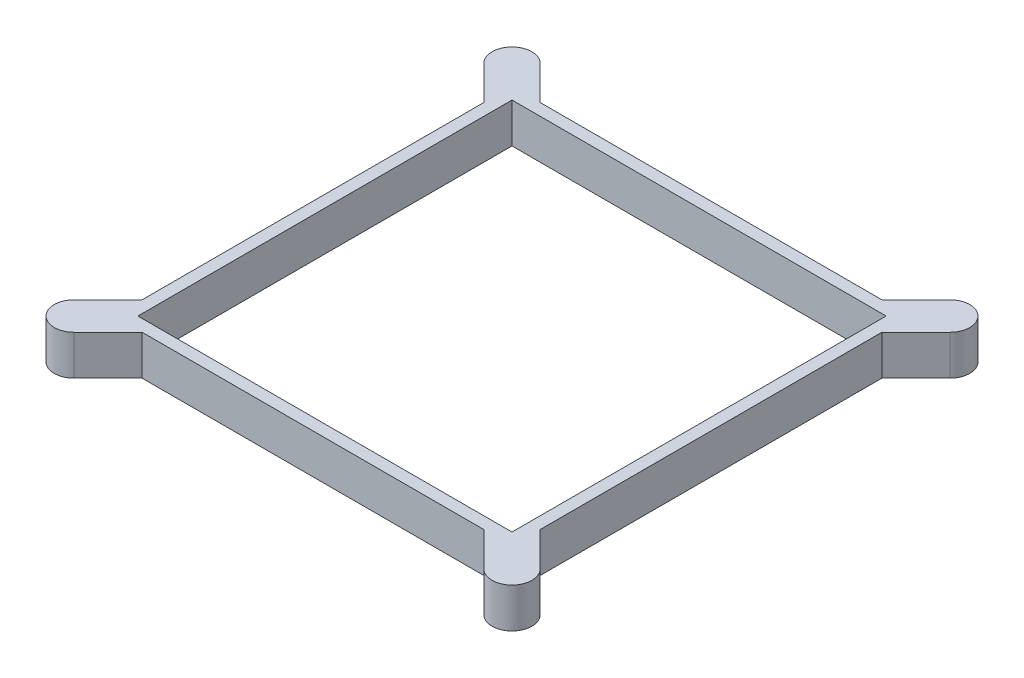
ISO-10303-21;
HEADER;
FILE_DESCRIPTION(('STEP AP214'),'2;1');
FILE_NAME('part.step','',(''),(''),'','','');
FILE_SCHEMA(('AUTOMOTIVE_DESIGN { 1 0 10303 214 1 1 1 1 }'));
ENDSEC;
DATA;
#1=APPLICATION_CONTEXT('core data for automotive mechanical design processes');
#2=APPLICATION_PROTOCOL_DEFINITION('international standard','automotive_design',2000,#1);
#3=PRODUCT_CONTEXT('',#1,'mechanical');
#4=PRODUCT('Part','Part','',(#3));
#5=PRODUCT_RELATED_PRODUCT_CATEGORY('part','',(#4));
#6=PRODUCT_DEFINITION_FORMATION('','',#4);
#7=PRODUCT_DEFINITION_CONTEXT('part definition',#1,'design');
#8=PRODUCT_DEFINITION('design','',#6,#7);
#9=PRODUCT_DEFINITION_SHAPE('','',#8);
#10=(LENGTH_UNIT() NAMED_UNIT(*) SI_UNIT(.MILLI.,.METRE.));
#11=(NAMED_UNIT(*) PLANE_ANGLE_UNIT() SI_UNIT($,.RADIAN.));
#12=(NAMED_UNIT(*) SI_UNIT($,.STERADIAN.) SOLID_ANGLE_UNIT());
#13=UNCERTAINTY_MEASURE_WITH_UNIT(LENGTH_MEASURE(1.E-05),#10,'distance_accuracy_value','');
#14=(GEOMETRIC_REPRESENTATION_CONTEXT(3) GLOBAL_UNCERTAINTY_ASSIGNED_CONTEXT((#13)) GLOBAL_UNIT_ASSIGNED_CONTEXT((#10,
#11,#12)) REPRESENTATION_CONTEXT('',''));
#15=CARTESIAN_POINT('',(0.,0.,0.));
#16=DIRECTION('',(0.,0.,1.));
#17=DIRECTION('',(1.,0.,0.));
#18=AXIS2_PLACEMENT_3D('',#15,#16,#17);
#19=CARTESIAN_POINT('',(200.,20.,0.));
#20=DIRECTION('',(-1.,0.,0.));
#21=DIRECTION('',(0.,0.,1.));
#22=AXIS2_PLACEMENT_3D('',#19,#20,#21);
#23=PLANE('',#22);
#24=DIRECTION('',(0.,-1.,0.));
#25=VECTOR('',#24,1.);
#26=CARTESIAN_POINT('',(200.,68.3076870304613,-185.857864376269));
#27=LINE('',#26,#25);
#28=CARTESIAN_POINT('',(200.,20.,-185.857864376269));
#29=VERTEX_POINT('',#28);
#30=CARTESIAN_POINT('',(200.,0.,-185.857864376269));
#31=VERTEX_POINT('',#30);
#32=EDGE_CURVE('E308',#29,#31,#27,.T.);
#33=ORIENTED_EDGE('',*,*,#32,.F.);
#34=DIRECTION('',(0.,0.,-1.));
#35=VECTOR('',#34,1.);
#36=CARTESIAN_POINT('',(200.,20.,0.));
#37=LINE('',#36,#35);
#38=CARTESIAN_POINT('',(200.,20.,-14.142135623731));
#39=VERTEX_POINT('',#38);
#40=EDGE_CURVE('E70',#39,#29,#37,.T.);
#41=ORIENTED_EDGE('',*,*,#40,.F.);
#42=DIRECTION('',(0.,-1.,0.));
#43=VECTOR('',#42,1.);
#44=CARTESIAN_POINT('',(200.,68.3076870304613,-14.142135623731));
#45=LINE('',#44,#43);
#46=CARTESIAN_POINT('',(200.,0.,-14.142135623731));
#47=VERTEX_POINT('',#46);
#48=EDGE_CURVE('E343',#39,#47,#45,.T.);
#49=ORIENTED_EDGE('',*,*,#48,.T.);
#50=DIRECTION('',(0.,0.,-1.));
#51=VECTOR('',#50,1.);
#52=CARTESIAN_POINT('',(200.,0.,0.));
#53=LINE('',#52,#51);
#54=EDGE_CURVE('E400',#47,#31,#53,.T.);
#55=ORIENTED_EDGE('',*,*,#54,.T.);
#56=EDGE_LOOP('',(#33,#41,#49,#55));
#57=FACE_BOUND('',#56,.T.);
#58=ADVANCED_FACE('F61',(#57),#23,.F.);
#59=CARTESIAN_POINT('',(0.,20.,-200.));
#60=DIRECTION('',(0.,0.,1.));
#61=DIRECTION('',(1.,0.,0.));
#62=AXIS2_PLACEMENT_3D('',#59,#60,#61);
#63=PLANE('',#62);
#64=DIRECTION('',(-1.,0.,0.));
#65=VECTOR('',#64,1.);
#66=CARTESIAN_POINT('',(0.,0.,-200.));
#67=LINE('',#66,#65);
#68=CARTESIAN_POINT('',(185.857864376269,0.,-200.));
#69=VERTEX_POINT('',#68);
#70=CARTESIAN_POINT('',(14.1421356237309,0.,-200.));
#71=VERTEX_POINT('',#70);
#72=EDGE_CURVE('E65',#69,#71,#67,.T.);
#73=ORIENTED_EDGE('',*,*,#72,.T.);
#74=DIRECTION('',(0.,-1.,0.));
#75=VECTOR('',#74,1.);
#76=CARTESIAN_POINT('',(14.142135623731,68.3076870304613,-200.));
#77=LINE('',#76,#75);
#78=CARTESIAN_POINT('',(14.1421356237309,20.,-200.));
#79=VERTEX_POINT('',#78);
#80=EDGE_CURVE('E268',#79,#71,#77,.T.);
#81=ORIENTED_EDGE('',*,*,#80,.F.);
#82=DIRECTION('',(-1.,0.,0.));
#83=VECTOR('',#82,1.);
#84=CARTESIAN_POINT('',(0.,20.,-200.));
#85=LINE('',#84,#83);
#86=CARTESIAN_POINT('',(185.857864376269,20.,-200.));
#87=VERTEX_POINT('',#86);
#88=EDGE_CURVE('E12',#87,#79,#85,.T.);
#89=ORIENTED_EDGE('',*,*,#88,.F.);
#90=DIRECTION('',(0.,-1.,0.));
#91=VECTOR('',#90,1.);
#92=CARTESIAN_POINT('',(185.857864376269,68.3076870304613,-200.));
#93=LINE('',#92,#91);
#94=EDGE_CURVE('E305',#87,#69,#93,.T.);
#95=ORIENTED_EDGE('',*,*,#94,.T.);
#96=EDGE_LOOP('',(#73,#81,#89,#95));
#97=FACE_BOUND('',#96,.T.);
#98=ADVANCED_FACE('F404',(#97),#63,.F.);
#99=CARTESIAN_POINT('',(0.,20.,0.));
#100=DIRECTION('',(1.,0.,0.));
#101=DIRECTION('',(0.,0.,-1.));
#102=AXIS2_PLACEMENT_3D('',#99,#100,#101);
#103=PLANE('',#102);
#104=DIRECTION('',(0.,0.,1.));
#105=VECTOR('',#104,1.);
#106=CARTESIAN_POINT('',(0.,20.,0.));
#107=LINE('',#106,#105);
#108=CARTESIAN_POINT('',(0.,20.,-185.857864376269));
#109=VERTEX_POINT('',#108);
#110=CARTESIAN_POINT('',(0.,20.,-14.142135623731));
#111=VERTEX_POINT('',#110);
#112=EDGE_CURVE('E391',#109,#111,#107,.T.);
#113=ORIENTED_EDGE('',*,*,#112,.F.);
#114=DIRECTION('',(0.,-1.,0.));
#115=VECTOR('',#114,1.);
#116=CARTESIAN_POINT('',(0.,68.3076870304613,-185.857864376269));
#117=LINE('',#116,#115);
#118=CARTESIAN_POINT('',(0.,0.,-185.857864376269));
#119=VERTEX_POINT('',#118);
#120=EDGE_CURVE('E266',#109,#119,#117,.T.);
#121=ORIENTED_EDGE('',*,*,#120,.T.);
#122=DIRECTION('',(0.,0.,1.));
#123=VECTOR('',#122,1.);
#124=CARTESIAN_POINT('',(0.,0.,0.));
#125=LINE('',#124,#123);
#126=CARTESIAN_POINT('',(0.,0.,-14.142135623731));
#127=VERTEX_POINT('',#126);
#128=EDGE_CURVE('E370',#119,#127,#125,.T.);
#129=ORIENTED_EDGE('',*,*,#128,.T.);
#130=DIRECTION('',(0.,-1.,0.));
#131=VECTOR('',#130,1.);
#132=CARTESIAN_POINT('',(0.,68.3076870304613,-14.142135623731));
#133=LINE('',#132,#131);
#134=EDGE_CURVE('E385',#111,#127,#133,.T.);
#135=ORIENTED_EDGE('',*,*,#134,.F.);
#136=EDGE_LOOP('',(#113,#121,#129,#135));
#137=FACE_BOUND('',#136,.T.);
#138=ADVANCED_FACE('F63',(#137),#103,.F.);
#139=CARTESIAN_POINT('',(0.,20.,0.));
#140=DIRECTION('',(0.,0.,-1.));
#141=DIRECTION('',(-1.,0.,0.));
#142=AXIS2_PLACEMENT_3D('',#139,#140,#141);
#143=PLANE('',#142);
#144=DIRECTION('',(1.,0.,0.));
#145=VECTOR('',#144,1.);
#146=CARTESIAN_POINT('',(0.,0.,0.));
#147=LINE('',#146,#145);
#148=CARTESIAN_POINT('',(14.142135623731,0.,0.));
#149=VERTEX_POINT('',#148);
#150=CARTESIAN_POINT('',(185.857864376269,0.,0.));
#151=VERTEX_POINT('',#150);
#152=EDGE_CURVE('E399',#149,#151,#147,.T.);
#153=ORIENTED_EDGE('',*,*,#152,.T.);
#154=DIRECTION('',(0.,-1.,0.));
#155=VECTOR('',#154,1.);
#156=CARTESIAN_POINT('',(185.857864376269,68.3076870304613,0.));
#157=LINE('',#156,#155);
#158=CARTESIAN_POINT('',(185.857864376269,20.,0.));
#159=VERTEX_POINT('',#158);
#160=EDGE_CURVE('E345',#159,#151,#157,.T.);
#161=ORIENTED_EDGE('',*,*,#160,.F.);
#162=DIRECTION('',(1.,0.,0.));
#163=VECTOR('',#162,1.);
#164=CARTESIAN_POINT('',(0.,20.,0.));
#165=LINE('',#164,#163);
#166=CARTESIAN_POINT('',(14.142135623731,20.,0.));
#167=VERTEX_POINT('',#166);
#168=EDGE_CURVE('E393',#167,#159,#165,.T.);
#169=ORIENTED_EDGE('',*,*,#168,.F.);
#170=DIRECTION('',(0.,-1.,0.));
#171=VECTOR('',#170,1.);
#172=CARTESIAN_POINT('',(14.142135623731,68.3076870304613,0.));
#173=LINE('',#172,#171);
#174=EDGE_CURVE('E382',#167,#149,#173,.T.);
#175=ORIENTED_EDGE('',*,*,#174,.T.);
#176=EDGE_LOOP('',(#153,#161,#169,#175));
#177=FACE_BOUND('',#176,.T.);
#178=ADVANCED_FACE('F486',(#177),#143,.F.);
#179=CARTESIAN_POINT('',(0.,20.,0.));
#180=DIRECTION('',(0.,-1.,0.));
#181=DIRECTION('',(0.,0.,-1.));
#182=AXIS2_PLACEMENT_3D('',#179,#180,#181);
#183=PLANE('',#182);
#184=DIRECTION('',(1.,0.,0.));
#185=VECTOR('',#184,1.);
#186=CARTESIAN_POINT('',(5.99999999999999,20.,-194.));
#187=LINE('',#186,#185);
#188=CARTESIAN_POINT('',(5.99999999999999,20.,-194.));
#189=VERTEX_POINT('',#188);
#190=CARTESIAN_POINT('',(194.,20.,-194.));
#191=VERTEX_POINT('',#190);
#192=EDGE_CURVE('E208',#189,#191,#187,.T.);
#193=ORIENTED_EDGE('',*,*,#192,.T.);
#194=DIRECTION('',(0.,0.,1.));
#195=VECTOR('',#194,1.);
#196=CARTESIAN_POINT('',(194.,20.,-194.));
#197=LINE('',#196,#195);
#198=CARTESIAN_POINT('',(194.,20.,-6.));
#199=VERTEX_POINT('',#198);
#200=EDGE_CURVE('E202',#191,#199,#197,.T.);
#201=ORIENTED_EDGE('',*,*,#200,.T.);
#202=DIRECTION('',(-1.,0.,0.));
#203=VECTOR('',#202,1.);
#204=CARTESIAN_POINT('',(6.,20.,-6.));
#205=LINE('',#204,#203);
#206=CARTESIAN_POINT('',(6.,20.,-6.));
#207=VERTEX_POINT('',#206);
#208=EDGE_CURVE('E211',#199,#207,#205,.T.);
#209=ORIENTED_EDGE('',*,*,#208,.T.);
#210=DIRECTION('',(0.,0.,-1.));
#211=VECTOR('',#210,1.);
#212=CARTESIAN_POINT('',(5.99999999999999,20.,-194.));
#213=LINE('',#212,#211);
#214=EDGE_CURVE('E78',#207,#189,#213,.T.);
#215=ORIENTED_EDGE('',*,*,#214,.T.);
#216=EDGE_LOOP('',(#193,#201,#209,#215));
#217=FACE_BOUND('',#216,.T.);
#218=DIRECTION('',(0.707106781186547,0.,0.707106781186548));
#219=VECTOR('',#218,1.);
#220=CARTESIAN_POINT('',(-7.07106781186548,20.,-192.928932188135));
#221=LINE('',#220,#219);
#222=CARTESIAN_POINT('',(-17.0876252708111,20.,-202.94548964708));
#223=VERTEX_POINT('',#222);
#224=EDGE_CURVE('E249',#223,#109,#221,.T.);
#225=ORIENTED_EDGE('',*,*,#224,.T.);
#226=ORIENTED_EDGE('',*,*,#112,.T.);
#227=DIRECTION('',(0.707106781186547,0.,-0.707106781186548));
#228=VECTOR('',#227,1.);
#229=CARTESIAN_POINT('',(-7.07106781186548,20.,-7.07106781186547));
#230=LINE('',#229,#228);
#231=CARTESIAN_POINT('',(-17.0876252708111,20.,2.94548964708019));
#232=VERTEX_POINT('',#231);
#233=EDGE_CURVE('E367',#232,#111,#230,.T.);
#234=ORIENTED_EDGE('',*,*,#233,.F.);
#235=CARTESIAN_POINT('',(-10.0165574589457,20.,10.0165574589457));
#236=DIRECTION('',(0.,-1.,0.));
#237=DIRECTION('',(0.,0.,-1.));
#238=AXIS2_PLACEMENT_3D('',#235,#236,#237);
#239=CIRCLE('',#238,10.);
#240=CARTESIAN_POINT('',(-2.9454896470802,20.,17.0876252708111));
#241=VERTEX_POINT('',#240);
#242=EDGE_CURVE('E366',#241,#232,#239,.T.);
#243=ORIENTED_EDGE('',*,*,#242,.F.);
#244=DIRECTION('',(-0.707106781186548,0.,0.707106781186547));
#245=VECTOR('',#244,1.);
#246=CARTESIAN_POINT('',(7.07106781186548,20.,7.07106781186548));
#247=LINE('',#246,#245);
#248=EDGE_CURVE('E363',#167,#241,#247,.T.);
#249=ORIENTED_EDGE('',*,*,#248,.F.);
#250=ORIENTED_EDGE('',*,*,#168,.T.);
#251=DIRECTION('',(0.707106781186548,0.,0.707106781186547));
#252=VECTOR('',#251,1.);
#253=CARTESIAN_POINT('',(192.928932188135,20.,7.07106781186548));
#254=LINE('',#253,#252);
#255=CARTESIAN_POINT('',(202.94548964708,20.,17.0876252708111));
#256=VERTEX_POINT('',#255);
#257=EDGE_CURVE('E332',#159,#256,#254,.T.);
#258=ORIENTED_EDGE('',*,*,#257,.T.);
#259=CARTESIAN_POINT('',(210.016557458946,20.,10.0165574589457));
#260=DIRECTION('',(0.,-1.,0.));
#261=DIRECTION('',(0.,0.,-1.));
#262=AXIS2_PLACEMENT_3D('',#259,#260,#261);
#263=CIRCLE('',#262,10.);
#264=CARTESIAN_POINT('',(217.087625270811,20.,2.94548964708019));
#265=VERTEX_POINT('',#264);
#266=EDGE_CURVE('E329',#256,#265,#263,.F.);
#267=ORIENTED_EDGE('',*,*,#266,.T.);
#268=DIRECTION('',(-0.707106781186547,0.,-0.707106781186548));
#269=VECTOR('',#268,1.);
#270=CARTESIAN_POINT('',(207.071067811865,20.,-7.07106781186547));
#271=LINE('',#270,#269);
#272=EDGE_CURVE('E326',#265,#39,#271,.T.);
#273=ORIENTED_EDGE('',*,*,#272,.T.);
#274=ORIENTED_EDGE('',*,*,#40,.T.);
#275=DIRECTION('',(-0.707106781186547,0.,0.707106781186548));
#276=VECTOR('',#275,1.);
#277=CARTESIAN_POINT('',(207.071067811865,20.,-192.928932188135));
#278=LINE('',#277,#276);
#279=CARTESIAN_POINT('',(217.087625270811,20.,-202.94548964708));
#280=VERTEX_POINT('',#279);
#281=EDGE_CURVE('E290',#280,#29,#278,.T.);
#282=ORIENTED_EDGE('',*,*,#281,.F.);
#283=CARTESIAN_POINT('',(210.016557458946,20.,-210.016557458946));
#284=DIRECTION('',(0.,-1.,0.));
#285=DIRECTION('',(0.,0.,-1.));
#286=AXIS2_PLACEMENT_3D('',#283,#284,#285);
#287=CIRCLE('',#286,10.);
#288=CARTESIAN_POINT('',(202.94548964708,20.,-217.087625270811));
#289=VERTEX_POINT('',#288);
#290=EDGE_CURVE('E289',#289,#280,#287,.T.);
#291=ORIENTED_EDGE('',*,*,#290,.F.);
#292=DIRECTION('',(0.707106781186548,0.,-0.707106781186547));
#293=VECTOR('',#292,1.);
#294=CARTESIAN_POINT('',(192.928932188135,20.,-207.071067811865));
#295=LINE('',#294,#293);
#296=EDGE_CURVE('E286',#87,#289,#295,.T.);
#297=ORIENTED_EDGE('',*,*,#296,.F.);
#298=ORIENTED_EDGE('',*,*,#88,.T.);
#299=DIRECTION('',(-0.707106781186548,0.,-0.707106781186547));
#300=VECTOR('',#299,1.);
#301=CARTESIAN_POINT('',(7.07106781186548,20.,-207.071067811865));
#302=LINE('',#301,#300);
#303=CARTESIAN_POINT('',(-2.9454896470802,20.,-217.087625270811));
#304=VERTEX_POINT('',#303);
#305=EDGE_CURVE('E255',#79,#304,#302,.T.);
#306=ORIENTED_EDGE('',*,*,#305,.T.);
#307=CARTESIAN_POINT('',(-10.0165574589457,20.,-210.016557458946));
#308=DIRECTION('',(0.,-1.,0.));
#309=DIRECTION('',(0.,0.,-1.));
#310=AXIS2_PLACEMENT_3D('',#307,#308,#309);
#311=CIRCLE('',#310,10.);
#312=EDGE_CURVE('E252',#304,#223,#311,.F.);
#313=ORIENTED_EDGE('',*,*,#312,.T.);
#314=EDGE_LOOP('',(#225,#226,#234,#243,#249,#250,#258,#267,#273,#274,#282,#291,#297,#298,#306,#313));
#315=FACE_BOUND('',#314,.T.);
#316=ADVANCED_FACE('F215',(#217,#315),#183,.F.);
#317=CARTESIAN_POINT('',(0.,0.,0.));
#318=DIRECTION('',(0.,-1.,0.));
#319=DIRECTION('',(0.,0.,-1.));
#320=AXIS2_PLACEMENT_3D('',#317,#318,#319);
#321=PLANE('',#320);
#322=DIRECTION('',(0.,0.,1.));
#323=VECTOR('',#322,1.);
#324=CARTESIAN_POINT('',(194.,0.,-194.));
#325=LINE('',#324,#323);
#326=CARTESIAN_POINT('',(194.,0.,-194.));
#327=VERTEX_POINT('',#326);
#328=CARTESIAN_POINT('',(194.,0.,-6.));
#329=VERTEX_POINT('',#328);
#330=EDGE_CURVE('E86',#327,#329,#325,.T.);
#331=ORIENTED_EDGE('',*,*,#330,.F.);
#332=DIRECTION('',(1.,0.,0.));
#333=VECTOR('',#332,1.);
#334=CARTESIAN_POINT('',(5.99999999999999,0.,-194.));
#335=LINE('',#334,#333);
#336=CARTESIAN_POINT('',(5.99999999999999,0.,-194.));
#337=VERTEX_POINT('',#336);
#338=EDGE_CURVE('E218',#337,#327,#335,.T.);
#339=ORIENTED_EDGE('',*,*,#338,.F.);
#340=DIRECTION('',(0.,0.,-1.));
#341=VECTOR('',#340,1.);
#342=CARTESIAN_POINT('',(5.99999999999999,0.,-194.));
#343=LINE('',#342,#341);
#344=CARTESIAN_POINT('',(6.,0.,-6.));
#345=VERTEX_POINT('',#344);
#346=EDGE_CURVE('E221',#345,#337,#343,.T.);
#347=ORIENTED_EDGE('',*,*,#346,.F.);
#348=DIRECTION('',(-1.,0.,0.));
#349=VECTOR('',#348,1.);
#350=CARTESIAN_POINT('',(6.,0.,-6.));
#351=LINE('',#350,#349);
#352=EDGE_CURVE('E227',#329,#345,#351,.T.);
#353=ORIENTED_EDGE('',*,*,#352,.F.);
#354=EDGE_LOOP('',(#331,#339,#347,#353));
#355=FACE_BOUND('',#354,.T.);
#356=CARTESIAN_POINT('',(-3.41536736099135,0.,-203.415367360991));
#357=DIRECTION('',(0.,1.,0.));
#358=DIRECTION('',(0.,0.,1.));
#359=AXIS2_PLACEMENT_3D('',#356,#357,#358);
#360=CIRCLE('',#359,3.79708670005155);
#361=CARTESIAN_POINT('',(-3.41536736099135,0.,-199.61828066094));
#362=VERTEX_POINT('',#361);
#363=EDGE_CURVE('E233',#362,#362,#360,.T.);
#364=ORIENTED_EDGE('',*,*,#363,.T.);
#365=EDGE_LOOP('',(#364));
#366=FACE_BOUND('',#365,.T.);
#367=CARTESIAN_POINT('',(-10.0165574589457,0.,-210.016557458946));
#368=DIRECTION('',(0.,1.,0.));
#369=DIRECTION('',(0.,0.,1.));
#370=AXIS2_PLACEMENT_3D('',#367,#368,#369);
#371=CIRCLE('',#370,3.79708670005155);
#372=CARTESIAN_POINT('',(-10.0165574589457,0.,-206.219470758894));
#373=VERTEX_POINT('',#372);
#374=EDGE_CURVE('E240',#373,#373,#371,.T.);
#375=ORIENTED_EDGE('',*,*,#374,.T.);
#376=EDGE_LOOP('',(#375));
#377=FACE_BOUND('',#376,.T.);
#378=ORIENTED_EDGE('',*,*,#128,.F.);
#379=DIRECTION('',(-0.707106781186547,0.,-0.707106781186548));
#380=VECTOR('',#379,1.);
#381=CARTESIAN_POINT('',(-7.07106781186548,0.,-192.928932188135));
#382=LINE('',#381,#380);
#383=CARTESIAN_POINT('',(-17.0876252708111,0.,-202.94548964708));
#384=VERTEX_POINT('',#383);
#385=EDGE_CURVE('E261',#119,#384,#382,.T.);
#386=ORIENTED_EDGE('',*,*,#385,.T.);
#387=CARTESIAN_POINT('',(-10.0165574589457,0.,-210.016557458946));
#388=DIRECTION('',(0.,1.,0.));
#389=DIRECTION('',(0.,0.,1.));
#390=AXIS2_PLACEMENT_3D('',#387,#388,#389);
#391=CIRCLE('',#390,10.);
#392=CARTESIAN_POINT('',(-2.9454896470802,0.,-217.087625270811));
#393=VERTEX_POINT('',#392);
#394=EDGE_CURVE('E246',#384,#393,#391,.F.);
#395=ORIENTED_EDGE('',*,*,#394,.T.);
#396=DIRECTION('',(0.707106781186548,0.,0.707106781186547));
#397=VECTOR('',#396,1.);
#398=CARTESIAN_POINT('',(7.07106781186548,0.,-207.071067811865));
#399=LINE('',#398,#397);
#400=EDGE_CURVE('E258',#393,#71,#399,.T.);
#401=ORIENTED_EDGE('',*,*,#400,.T.);
#402=ORIENTED_EDGE('',*,*,#72,.F.);
#403=DIRECTION('',(-0.707106781186548,0.,0.707106781186547));
#404=VECTOR('',#403,1.);
#405=CARTESIAN_POINT('',(192.928932188135,0.,-207.071067811865));
#406=LINE('',#405,#404);
#407=CARTESIAN_POINT('',(202.94548964708,0.,-217.087625270811));
#408=VERTEX_POINT('',#407);
#409=EDGE_CURVE('E299',#408,#69,#406,.T.);
#410=ORIENTED_EDGE('',*,*,#409,.F.);
#411=CARTESIAN_POINT('',(210.016557458946,0.,-210.016557458946));
#412=DIRECTION('',(0.,-1.,0.));
#413=DIRECTION('',(0.,0.,1.));
#414=AXIS2_PLACEMENT_3D('',#411,#412,#413);
#415=CIRCLE('',#414,10.);
#416=CARTESIAN_POINT('',(217.087625270811,0.,-202.94548964708));
#417=VERTEX_POINT('',#416);
#418=EDGE_CURVE('E283',#417,#408,#415,.F.);
#419=ORIENTED_EDGE('',*,*,#418,.F.);
#420=DIRECTION('',(0.707106781186547,0.,-0.707106781186548));
#421=VECTOR('',#420,1.);
#422=CARTESIAN_POINT('',(207.071067811865,0.,-192.928932188135));
#423=LINE('',#422,#421);
#424=EDGE_CURVE('E296',#31,#417,#423,.T.);
#425=ORIENTED_EDGE('',*,*,#424,.F.);
#426=ORIENTED_EDGE('',*,*,#54,.F.);
#427=DIRECTION('',(0.707106781186547,0.,0.707106781186548));
#428=VECTOR('',#427,1.);
#429=CARTESIAN_POINT('',(207.071067811865,0.,-7.07106781186547));
#430=LINE('',#429,#428);
#431=CARTESIAN_POINT('',(217.087625270811,0.,2.94548964708019));
#432=VERTEX_POINT('',#431);
#433=EDGE_CURVE('E338',#47,#432,#430,.T.);
#434=ORIENTED_EDGE('',*,*,#433,.T.);
#435=CARTESIAN_POINT('',(210.016557458946,0.,10.0165574589457));
#436=DIRECTION('',(0.,1.,0.));
#437=DIRECTION('',(0.,0.,-1.));
#438=AXIS2_PLACEMENT_3D('',#435,#436,#437);
#439=CIRCLE('',#438,10.);
#440=CARTESIAN_POINT('',(202.94548964708,0.,17.0876252708111));
#441=VERTEX_POINT('',#440);
#442=EDGE_CURVE('E323',#432,#441,#439,.F.);
#443=ORIENTED_EDGE('',*,*,#442,.T.);
#444=DIRECTION('',(-0.707106781186548,0.,-0.707106781186547));
#445=VECTOR('',#444,1.);
#446=CARTESIAN_POINT('',(192.928932188135,0.,7.07106781186548));
#447=LINE('',#446,#445);
#448=EDGE_CURVE('E335',#441,#151,#447,.T.);
#449=ORIENTED_EDGE('',*,*,#448,.T.);
#450=ORIENTED_EDGE('',*,*,#152,.F.);
#451=DIRECTION('',(0.707106781186548,0.,-0.707106781186547));
#452=VECTOR('',#451,1.);
#453=CARTESIAN_POINT('',(7.07106781186548,0.,7.07106781186548));
#454=LINE('',#453,#452);
#455=CARTESIAN_POINT('',(-2.9454896470802,0.,17.0876252708111));
#456=VERTEX_POINT('',#455);
#457=EDGE_CURVE('E376',#456,#149,#454,.T.);
#458=ORIENTED_EDGE('',*,*,#457,.F.);
#459=CARTESIAN_POINT('',(-10.0165574589457,0.,10.0165574589457));
#460=DIRECTION('',(0.,-1.,0.));
#461=DIRECTION('',(0.,0.,-1.));
#462=AXIS2_PLACEMENT_3D('',#459,#460,#461);
#463=CIRCLE('',#462,10.);
#464=CARTESIAN_POINT('',(-17.0876252708111,0.,2.94548964708019));
#465=VERTEX_POINT('',#464);
#466=EDGE_CURVE('E360',#465,#456,#463,.F.);
#467=ORIENTED_EDGE('',*,*,#466,.F.);
#468=DIRECTION('',(-0.707106781186547,0.,0.707106781186548));
#469=VECTOR('',#468,1.);
#470=CARTESIAN_POINT('',(-7.07106781186548,0.,-7.07106781186547));
#471=LINE('',#470,#469);
#472=EDGE_CURVE('E373',#127,#465,#471,.T.);
#473=ORIENTED_EDGE('',*,*,#472,.F.);
#474=EDGE_LOOP('',(#378,#386,#395,#401,#402,#410,#419,#425,#426,#434,#443,#449,#450,#458,#467,#473));
#475=FACE_BOUND('',#474,.T.);
#476=CARTESIAN_POINT('',(203.415367360991,0.,-203.415367360991));
#477=DIRECTION('',(0.,-1.,0.));
#478=DIRECTION('',(0.,0.,1.));
#479=AXIS2_PLACEMENT_3D('',#476,#477,#478);
#480=CIRCLE('',#479,3.79708670005155);
#481=CARTESIAN_POINT('',(203.415367360991,0.,-199.61828066094));
#482=VERTEX_POINT('',#481);
#483=EDGE_CURVE('E273',#482,#482,#480,.T.);
#484=ORIENTED_EDGE('',*,*,#483,.F.);
#485=EDGE_LOOP('',(#484));
#486=FACE_BOUND('',#485,.T.);
#487=CARTESIAN_POINT('',(210.016557458946,0.,-210.016557458946));
#488=DIRECTION('',(0.,-1.,0.));
#489=DIRECTION('',(0.,0.,1.));
#490=AXIS2_PLACEMENT_3D('',#487,#488,#489);
#491=CIRCLE('',#490,3.79708670005155);
#492=CARTESIAN_POINT('',(210.016557458946,0.,-206.219470758894));
#493=VERTEX_POINT('',#492);
#494=EDGE_CURVE('E277',#493,#493,#491,.T.);
#495=ORIENTED_EDGE('',*,*,#494,.F.);
#496=EDGE_LOOP('',(#495));
#497=FACE_BOUND('',#496,.T.);
#498=CARTESIAN_POINT('',(203.415367360991,0.,3.41536736099135));
#499=DIRECTION('',(0.,1.,0.));
#500=DIRECTION('',(0.,0.,-1.));
#501=AXIS2_PLACEMENT_3D('',#498,#499,#500);
#502=CIRCLE('',#501,3.79708670005155);
#503=CARTESIAN_POINT('',(203.415367360991,0.,-0.381719339060196));
#504=VERTEX_POINT('',#503);
#505=EDGE_CURVE('E293',#504,#504,#502,.T.);
#506=ORIENTED_EDGE('',*,*,#505,.T.);
#507=EDGE_LOOP('',(#506));
#508=FACE_BOUND('',#507,.T.);
#509=CARTESIAN_POINT('',(210.016557458946,0.,10.0165574589457));
#510=DIRECTION('',(0.,1.,0.));
#511=DIRECTION('',(0.,0.,-1.));
#512=AXIS2_PLACEMENT_3D('',#509,#510,#511);
#513=CIRCLE('',#512,3.79708670005155);
#514=CARTESIAN_POINT('',(210.016557458946,0.,6.21947075889412));
#515=VERTEX_POINT('',#514);
#516=EDGE_CURVE('E317',#515,#515,#513,.T.);
#517=ORIENTED_EDGE('',*,*,#516,.T.);
#518=EDGE_LOOP('',(#517));
#519=FACE_BOUND('',#518,.T.);
#520=CARTESIAN_POINT('',(-3.41536736099135,0.,3.41536736099135));
#521=DIRECTION('',(0.,-1.,0.));
#522=DIRECTION('',(0.,0.,-1.));
#523=AXIS2_PLACEMENT_3D('',#520,#521,#522);
#524=CIRCLE('',#523,3.79708670005155);
#525=CARTESIAN_POINT('',(-3.41536736099135,0.,-0.381719339060196));
#526=VERTEX_POINT('',#525);
#527=EDGE_CURVE('E350',#526,#526,#524,.T.);
#528=ORIENTED_EDGE('',*,*,#527,.F.);
#529=EDGE_LOOP('',(#528));
#530=FACE_BOUND('',#529,.T.);
#531=CARTESIAN_POINT('',(-10.0165574589457,0.,10.0165574589457));
#532=DIRECTION('',(0.,-1.,0.));
#533=DIRECTION('',(0.,0.,-1.));
#534=AXIS2_PLACEMENT_3D('',#531,#532,#533);
#535=CIRCLE('',#534,3.79708670005155);
#536=CARTESIAN_POINT('',(-10.0165574589457,0.,6.21947075889412));
#537=VERTEX_POINT('',#536);
#538=EDGE_CURVE('E354',#537,#537,#535,.T.);
#539=ORIENTED_EDGE('',*,*,#538,.F.);
#540=EDGE_LOOP('',(#539));
#541=FACE_BOUND('',#540,.T.);
#542=ADVANCED_FACE('F414',(#355,#366,#377,#475,#486,#497,#508,#519,#530,#541),#321,.T.);
#543=CARTESIAN_POINT('',(-7.07106781186548,68.3076870304613,-7.07106781186547));
#544=DIRECTION('',(0.707106781186548,0.,0.707106781186547));
#545=DIRECTION('',(0.707106781186547,0.,-0.707106781186548));
#546=AXIS2_PLACEMENT_3D('',#543,#544,#545);
#547=PLANE('',#546);
#548=DIRECTION('',(0.,-1.,0.));
#549=VECTOR('',#548,1.);
#550=CARTESIAN_POINT('',(-17.0876252708111,68.3076870304613,2.94548964708019));
#551=LINE('',#550,#549);
#552=EDGE_CURVE('E379',#232,#465,#551,.T.);
#553=ORIENTED_EDGE('',*,*,#552,.F.);
#554=ORIENTED_EDGE('',*,*,#233,.T.);
#555=ORIENTED_EDGE('',*,*,#134,.T.);
#556=ORIENTED_EDGE('',*,*,#472,.T.);
#557=EDGE_LOOP('',(#553,#554,#555,#556));
#558=FACE_BOUND('',#557,.T.);
#559=ADVANCED_FACE('F433',(#558),#547,.F.);
#560=CARTESIAN_POINT('',(7.07106781186548,68.3076870304613,7.07106781186548));
#561=DIRECTION('',(-0.707106781186547,0.,-0.707106781186548));
#562=DIRECTION('',(-0.707106781186548,0.,0.707106781186547));
#563=AXIS2_PLACEMENT_3D('',#560,#561,#562);
#564=PLANE('',#563);
#565=ORIENTED_EDGE('',*,*,#174,.F.);
#566=ORIENTED_EDGE('',*,*,#248,.T.);
#567=DIRECTION('',(0.,-1.,0.));
#568=VECTOR('',#567,1.);
#569=CARTESIAN_POINT('',(-2.9454896470802,68.3076870304613,17.0876252708111));
#570=LINE('',#569,#568);
#571=EDGE_CURVE('E380',#241,#456,#570,.T.);
#572=ORIENTED_EDGE('',*,*,#571,.T.);
#573=ORIENTED_EDGE('',*,*,#457,.T.);
#574=EDGE_LOOP('',(#565,#566,#572,#573));
#575=FACE_BOUND('',#574,.T.);
#576=ADVANCED_FACE('F440',(#575),#564,.F.);
#577=CARTESIAN_POINT('',(-10.0165574589457,68.3076870304613,10.0165574589457));
#578=DIRECTION('',(0.,-1.,0.));
#579=DIRECTION('',(0.,0.,-1.));
#580=AXIS2_PLACEMENT_3D('',#577,#578,#579);
#581=CYLINDRICAL_SURFACE('',#580,10.);
#582=ORIENTED_EDGE('',*,*,#571,.F.);
#583=ORIENTED_EDGE('',*,*,#242,.T.);
#584=ORIENTED_EDGE('',*,*,#552,.T.);
#585=ORIENTED_EDGE('',*,*,#466,.T.);
#586=EDGE_LOOP('',(#582,#583,#584,#585));
#587=FACE_BOUND('',#586,.T.);
#588=ADVANCED_FACE('F437',(#587),#581,.T.);
#589=CARTESIAN_POINT('',(-10.0165574589457,10.,10.0165574589457));
#590=DIRECTION('',(0.,-1.,0.));
#591=DIRECTION('',(0.,0.,-1.));
#592=AXIS2_PLACEMENT_3D('',#589,#590,#591);
#593=CYLINDRICAL_SURFACE('',#592,3.79708670005155);
#594=CARTESIAN_POINT('',(-10.0165574589457,10.,10.0165574589457));
#595=DIRECTION('',(0.,-1.,0.));
#596=DIRECTION('',(0.,0.,-1.));
#597=AXIS2_PLACEMENT_3D('',#594,#595,#596);
#598=CIRCLE('',#597,3.79708670005155);
#599=CARTESIAN_POINT('',(-10.0165574589457,10.,6.21947075889412));
#600=VERTEX_POINT('',#599);
#601=EDGE_CURVE('E357',#600,#600,#598,.T.);
#602=ORIENTED_EDGE('',*,*,#601,.F.);
#603=EDGE_LOOP('',(#602));
#604=FACE_BOUND('',#603,.T.);
#605=ORIENTED_EDGE('',*,*,#538,.T.);
#606=EDGE_LOOP('',(#605));
#607=FACE_BOUND('',#606,.T.);
#608=ADVANCED_FACE('F607',(#604,#607),#593,.F.);
#609=CARTESIAN_POINT('',(0.,10.,0.));
#610=DIRECTION('',(0.,-1.,0.));
#611=DIRECTION('',(0.,0.,-1.));
#612=AXIS2_PLACEMENT_3D('',#609,#610,#611);
#613=PLANE('',#612);
#614=ORIENTED_EDGE('',*,*,#601,.T.);
#615=EDGE_LOOP('',(#614));
#616=FACE_BOUND('',#615,.T.);
#617=ADVANCED_FACE('F597',(#616),#613,.T.);
#618=CARTESIAN_POINT('',(-3.41536736099135,10.,3.41536736099135));
#619=DIRECTION('',(0.,-1.,0.));
#620=DIRECTION('',(0.,0.,-1.));
#621=AXIS2_PLACEMENT_3D('',#618,#619,#620);
#622=CYLINDRICAL_SURFACE('',#621,3.79708670005155);
#623=CARTESIAN_POINT('',(-3.41536736099135,10.,3.41536736099135));
#624=DIRECTION('',(0.,-1.,0.));
#625=DIRECTION('',(0.,0.,-1.));
#626=AXIS2_PLACEMENT_3D('',#623,#624,#625);
#627=CIRCLE('',#626,3.79708670005155);
#628=CARTESIAN_POINT('',(-3.41536736099135,10.,-0.381719339060196));
#629=VERTEX_POINT('',#628);
#630=EDGE_CURVE('E351',#629,#629,#627,.T.);
#631=ORIENTED_EDGE('',*,*,#630,.F.);
#632=EDGE_LOOP('',(#631));
#633=FACE_BOUND('',#632,.T.);
#634=ORIENTED_EDGE('',*,*,#527,.T.);
#635=EDGE_LOOP('',(#634));
#636=FACE_BOUND('',#635,.T.);
#637=ADVANCED_FACE('F586',(#633,#636),#622,.F.);
#638=CARTESIAN_POINT('',(0.,10.,0.));
#639=DIRECTION('',(0.,-1.,0.));
#640=DIRECTION('',(0.,0.,-1.));
#641=AXIS2_PLACEMENT_3D('',#638,#639,#640);
#642=PLANE('',#641);
#643=ORIENTED_EDGE('',*,*,#630,.T.);
#644=EDGE_LOOP('',(#643));
#645=FACE_BOUND('',#644,.T.);
#646=ADVANCED_FACE('F570',(#645),#642,.T.);
#647=CARTESIAN_POINT('',(210.016557458946,68.3076870304613,10.0165574589457));
#648=DIRECTION('',(0.,-1.,0.));
#649=DIRECTION('',(0.,0.,-1.));
#650=AXIS2_PLACEMENT_3D('',#647,#648,#649);
#651=CYLINDRICAL_SURFACE('',#650,10.);
#652=ORIENTED_EDGE('',*,*,#266,.F.);
#653=DIRECTION('',(0.,-1.,0.));
#654=VECTOR('',#653,1.);
#655=CARTESIAN_POINT('',(202.94548964708,68.3076870304613,17.0876252708111));
#656=LINE('',#655,#654);
#657=EDGE_CURVE('E341',#256,#441,#656,.T.);
#658=ORIENTED_EDGE('',*,*,#657,.T.);
#659=ORIENTED_EDGE('',*,*,#442,.F.);
#660=DIRECTION('',(0.,-1.,0.));
#661=VECTOR('',#660,1.);
#662=CARTESIAN_POINT('',(217.087625270811,68.3076870304613,2.94548964708019));
#663=LINE('',#662,#661);
#664=EDGE_CURVE('E330',#265,#432,#663,.T.);
#665=ORIENTED_EDGE('',*,*,#664,.F.);
#666=EDGE_LOOP('',(#652,#658,#659,#665));
#667=FACE_BOUND('',#666,.T.);
#668=ADVANCED_FACE('F450',(#667),#651,.T.);
#669=CARTESIAN_POINT('',(207.071067811865,68.3076870304613,-7.07106781186547));
#670=DIRECTION('',(0.707106781186548,0.,-0.707106781186547));
#671=DIRECTION('',(-0.707106781186547,0.,-0.707106781186548));
#672=AXIS2_PLACEMENT_3D('',#669,#670,#671);
#673=PLANE('',#672);
#674=ORIENTED_EDGE('',*,*,#272,.F.);
#675=ORIENTED_EDGE('',*,*,#664,.T.);
#676=ORIENTED_EDGE('',*,*,#433,.F.);
#677=ORIENTED_EDGE('',*,*,#48,.F.);
#678=EDGE_LOOP('',(#674,#675,#676,#677));
#679=FACE_BOUND('',#678,.T.);
#680=ADVANCED_FACE('F455',(#679),#673,.T.);
#681=CARTESIAN_POINT('',(192.928932188135,68.3076870304613,7.07106781186548));
#682=DIRECTION('',(-0.707106781186547,0.,0.707106781186548));
#683=DIRECTION('',(0.707106781186548,0.,0.707106781186547));
#684=AXIS2_PLACEMENT_3D('',#681,#682,#683);
#685=PLANE('',#684);
#686=ORIENTED_EDGE('',*,*,#257,.F.);
#687=ORIENTED_EDGE('',*,*,#160,.T.);
#688=ORIENTED_EDGE('',*,*,#448,.F.);
#689=ORIENTED_EDGE('',*,*,#657,.F.);
#690=EDGE_LOOP('',(#686,#687,#688,#689));
#691=FACE_BOUND('',#690,.T.);
#692=ADVANCED_FACE('F446',(#691),#685,.T.);
#693=CARTESIAN_POINT('',(210.016557458946,10.,10.0165574589457));
#694=DIRECTION('',(0.,-1.,0.));
#695=DIRECTION('',(0.,0.,-1.));
#696=AXIS2_PLACEMENT_3D('',#693,#694,#695);
#697=CYLINDRICAL_SURFACE('',#696,3.79708670005155);
#698=CARTESIAN_POINT('',(210.016557458946,10.,10.0165574589457));
#699=DIRECTION('',(0.,1.,0.));
#700=DIRECTION('',(0.,0.,-1.));
#701=AXIS2_PLACEMENT_3D('',#698,#699,#700);
#702=CIRCLE('',#701,3.79708670005155);
#703=CARTESIAN_POINT('',(210.016557458946,10.,6.21947075889412));
#704=VERTEX_POINT('',#703);
#705=EDGE_CURVE('E320',#704,#704,#702,.T.);
#706=ORIENTED_EDGE('',*,*,#705,.T.);
#707=EDGE_LOOP('',(#706));
#708=FACE_BOUND('',#707,.T.);
#709=ORIENTED_EDGE('',*,*,#516,.F.);
#710=EDGE_LOOP('',(#709));
#711=FACE_BOUND('',#710,.T.);
#712=ADVANCED_FACE('F534',(#708,#711),#697,.F.);
#713=CARTESIAN_POINT('',(200.,10.,0.));
#714=DIRECTION('',(0.,-1.,0.));
#715=DIRECTION('',(0.,0.,-1.));
#716=AXIS2_PLACEMENT_3D('',#713,#714,#715);
#717=PLANE('',#716);
#718=ORIENTED_EDGE('',*,*,#705,.F.);
#719=EDGE_LOOP('',(#718));
#720=FACE_BOUND('',#719,.T.);
#721=ADVANCED_FACE('F524',(#720),#717,.T.);
#722=CARTESIAN_POINT('',(203.415367360991,10.,3.41536736099135));
#723=DIRECTION('',(0.,-1.,0.));
#724=DIRECTION('',(0.,0.,-1.));
#725=AXIS2_PLACEMENT_3D('',#722,#723,#724);
#726=CYLINDRICAL_SURFACE('',#725,3.79708670005155);
#727=CARTESIAN_POINT('',(203.415367360991,10.,3.41536736099135));
#728=DIRECTION('',(0.,1.,0.));
#729=DIRECTION('',(0.,0.,-1.));
#730=AXIS2_PLACEMENT_3D('',#727,#728,#729);
#731=CIRCLE('',#730,3.79708670005155);
#732=CARTESIAN_POINT('',(203.415367360991,10.,-0.381719339060196));
#733=VERTEX_POINT('',#732);
#734=EDGE_CURVE('E314',#733,#733,#731,.T.);
#735=ORIENTED_EDGE('',*,*,#734,.T.);
#736=EDGE_LOOP('',(#735));
#737=FACE_BOUND('',#736,.T.);
#738=ORIENTED_EDGE('',*,*,#505,.F.);
#739=EDGE_LOOP('',(#738));
#740=FACE_BOUND('',#739,.T.);
#741=ADVANCED_FACE('F514',(#737,#740),#726,.F.);
#742=CARTESIAN_POINT('',(200.,10.,0.));
#743=DIRECTION('',(0.,-1.,0.));
#744=DIRECTION('',(0.,0.,-1.));
#745=AXIS2_PLACEMENT_3D('',#742,#743,#744);
#746=PLANE('',#745);
#747=ORIENTED_EDGE('',*,*,#734,.F.);
#748=EDGE_LOOP('',(#747));
#749=FACE_BOUND('',#748,.T.);
#750=ADVANCED_FACE('F476',(#749),#746,.T.);
#751=CARTESIAN_POINT('',(207.071067811865,68.3076870304613,-192.928932188135));
#752=DIRECTION('',(-0.707106781186548,0.,-0.707106781186547));
#753=DIRECTION('',(-0.707106781186547,0.,0.707106781186548));
#754=AXIS2_PLACEMENT_3D('',#751,#752,#753);
#755=PLANE('',#754);
#756=DIRECTION('',(0.,-1.,0.));
#757=VECTOR('',#756,1.);
#758=CARTESIAN_POINT('',(217.087625270811,68.3076870304613,-202.94548964708));
#759=LINE('',#758,#757);
#760=EDGE_CURVE('E302',#280,#417,#759,.T.);
#761=ORIENTED_EDGE('',*,*,#760,.F.);
#762=ORIENTED_EDGE('',*,*,#281,.T.);
#763=ORIENTED_EDGE('',*,*,#32,.T.);
#764=ORIENTED_EDGE('',*,*,#424,.T.);
#765=EDGE_LOOP('',(#761,#762,#763,#764));
#766=FACE_BOUND('',#765,.T.);
#767=ADVANCED_FACE('F461',(#766),#755,.F.);
#768=CARTESIAN_POINT('',(192.928932188135,68.3076870304613,-207.071067811865));
#769=DIRECTION('',(0.707106781186547,0.,0.707106781186548));
#770=DIRECTION('',(0.707106781186548,0.,-0.707106781186547));
#771=AXIS2_PLACEMENT_3D('',#768,#769,#770);
#772=PLANE('',#771);
#773=ORIENTED_EDGE('',*,*,#94,.F.);
#774=ORIENTED_EDGE('',*,*,#296,.T.);
#775=DIRECTION('',(0.,-1.,0.));
#776=VECTOR('',#775,1.);
#777=CARTESIAN_POINT('',(202.94548964708,68.3076870304613,-217.087625270811));
#778=LINE('',#777,#776);
#779=EDGE_CURVE('E303',#289,#408,#778,.T.);
#780=ORIENTED_EDGE('',*,*,#779,.T.);
#781=ORIENTED_EDGE('',*,*,#409,.T.);
#782=EDGE_LOOP('',(#773,#774,#780,#781));
#783=FACE_BOUND('',#782,.T.);
#784=ADVANCED_FACE('F467',(#783),#772,.F.);
#785=CARTESIAN_POINT('',(210.016557458946,68.3076870304613,-210.016557458946));
#786=DIRECTION('',(0.,-1.,0.));
#787=DIRECTION('',(0.,0.,-1.));
#788=AXIS2_PLACEMENT_3D('',#785,#786,#787);
#789=CYLINDRICAL_SURFACE('',#788,10.);
#790=ORIENTED_EDGE('',*,*,#779,.F.);
#791=ORIENTED_EDGE('',*,*,#290,.T.);
#792=ORIENTED_EDGE('',*,*,#760,.T.);
#793=ORIENTED_EDGE('',*,*,#418,.T.);
#794=EDGE_LOOP('',(#790,#791,#792,#793));
#795=FACE_BOUND('',#794,.T.);
#796=ADVANCED_FACE('F465',(#795),#789,.T.);
#797=CARTESIAN_POINT('',(210.016557458946,10.,-210.016557458946));
#798=DIRECTION('',(0.,-1.,0.));
#799=DIRECTION('',(0.,0.,-1.));
#800=AXIS2_PLACEMENT_3D('',#797,#798,#799);
#801=CYLINDRICAL_SURFACE('',#800,3.79708670005155);
#802=CARTESIAN_POINT('',(210.016557458946,10.,-210.016557458946));
#803=DIRECTION('',(0.,-1.,0.));
#804=DIRECTION('',(0.,0.,1.));
#805=AXIS2_PLACEMENT_3D('',#802,#803,#804);
#806=CIRCLE('',#805,3.79708670005155);
#807=CARTESIAN_POINT('',(210.016557458946,10.,-206.219470758894));
#808=VERTEX_POINT('',#807);
#809=EDGE_CURVE('E280',#808,#808,#806,.T.);
#810=ORIENTED_EDGE('',*,*,#809,.F.);
#811=EDGE_LOOP('',(#810));
#812=FACE_BOUND('',#811,.T.);
#813=ORIENTED_EDGE('',*,*,#494,.T.);
#814=EDGE_LOOP('',(#813));
#815=FACE_BOUND('',#814,.T.);
#816=ADVANCED_FACE('F474',(#812,#815),#801,.F.);
#817=CARTESIAN_POINT('',(200.,10.,-200.));
#818=DIRECTION('',(0.,-1.,0.));
#819=DIRECTION('',(0.,0.,1.));
#820=AXIS2_PLACEMENT_3D('',#817,#818,#819);
#821=PLANE('',#820);
#822=ORIENTED_EDGE('',*,*,#809,.T.);
#823=EDGE_LOOP('',(#822));
#824=FACE_BOUND('',#823,.T.);
#825=ADVANCED_FACE('F745',(#824),#821,.T.);
#826=CARTESIAN_POINT('',(203.415367360991,10.,-203.415367360991));
#827=DIRECTION('',(0.,-1.,0.));
#828=DIRECTION('',(0.,0.,-1.));
#829=AXIS2_PLACEMENT_3D('',#826,#827,#828);
#830=CYLINDRICAL_SURFACE('',#829,3.79708670005155);
#831=CARTESIAN_POINT('',(203.415367360991,10.,-203.415367360991));
#832=DIRECTION('',(0.,-1.,0.));
#833=DIRECTION('',(0.,0.,1.));
#834=AXIS2_PLACEMENT_3D('',#831,#832,#833);
#835=CIRCLE('',#834,3.79708670005155);
#836=CARTESIAN_POINT('',(203.415367360991,10.,-199.61828066094));
#837=VERTEX_POINT('',#836);
#838=EDGE_CURVE('E274',#837,#837,#835,.T.);
#839=ORIENTED_EDGE('',*,*,#838,.F.);
#840=EDGE_LOOP('',(#839));
#841=FACE_BOUND('',#840,.T.);
#842=ORIENTED_EDGE('',*,*,#483,.T.);
#843=EDGE_LOOP('',(#842));
#844=FACE_BOUND('',#843,.T.);
#845=ADVANCED_FACE('F735',(#841,#844),#830,.F.);
#846=CARTESIAN_POINT('',(200.,10.,-200.));
#847=DIRECTION('',(0.,-1.,0.));
#848=DIRECTION('',(0.,0.,1.));
#849=AXIS2_PLACEMENT_3D('',#846,#847,#848);
#850=PLANE('',#849);
#851=ORIENTED_EDGE('',*,*,#838,.T.);
#852=EDGE_LOOP('',(#851));
#853=FACE_BOUND('',#852,.T.);
#854=ADVANCED_FACE('F726',(#853),#850,.T.);
#855=CARTESIAN_POINT('',(-10.0165574589457,68.3076870304613,-210.016557458946));
#856=DIRECTION('',(0.,-1.,0.));
#857=DIRECTION('',(0.,0.,-1.));
#858=AXIS2_PLACEMENT_3D('',#855,#856,#857);
#859=CYLINDRICAL_SURFACE('',#858,10.);
#860=ORIENTED_EDGE('',*,*,#312,.F.);
#861=DIRECTION('',(0.,-1.,0.));
#862=VECTOR('',#861,1.);
#863=CARTESIAN_POINT('',(-2.9454896470802,68.3076870304613,-217.087625270811));
#864=LINE('',#863,#862);
#865=EDGE_CURVE('E264',#304,#393,#864,.T.);
#866=ORIENTED_EDGE('',*,*,#865,.T.);
#867=ORIENTED_EDGE('',*,*,#394,.F.);
#868=DIRECTION('',(0.,-1.,0.));
#869=VECTOR('',#868,1.);
#870=CARTESIAN_POINT('',(-17.0876252708111,68.3076870304613,-202.94548964708));
#871=LINE('',#870,#869);
#872=EDGE_CURVE('E253',#223,#384,#871,.T.);
#873=ORIENTED_EDGE('',*,*,#872,.F.);
#874=EDGE_LOOP('',(#860,#866,#867,#873));
#875=FACE_BOUND('',#874,.T.);
#876=ADVANCED_FACE('F421',(#875),#859,.T.);
#877=CARTESIAN_POINT('',(-7.07106781186548,68.3076870304613,-192.928932188135));
#878=DIRECTION('',(-0.707106781186548,0.,0.707106781186547));
#879=DIRECTION('',(0.707106781186547,0.,0.707106781186548));
#880=AXIS2_PLACEMENT_3D('',#877,#878,#879);
#881=PLANE('',#880);
#882=ORIENTED_EDGE('',*,*,#224,.F.);
#883=ORIENTED_EDGE('',*,*,#872,.T.);
#884=ORIENTED_EDGE('',*,*,#385,.F.);
#885=ORIENTED_EDGE('',*,*,#120,.F.);
#886=EDGE_LOOP('',(#882,#883,#884,#885));
#887=FACE_BOUND('',#886,.T.);
#888=ADVANCED_FACE('F425',(#887),#881,.T.);
#889=CARTESIAN_POINT('',(7.07106781186548,68.3076870304613,-207.071067811865));
#890=DIRECTION('',(0.707106781186547,0.,-0.707106781186548));
#891=DIRECTION('',(-0.707106781186548,0.,-0.707106781186547));
#892=AXIS2_PLACEMENT_3D('',#889,#890,#891);
#893=PLANE('',#892);
#894=ORIENTED_EDGE('',*,*,#305,.F.);
#895=ORIENTED_EDGE('',*,*,#80,.T.);
#896=ORIENTED_EDGE('',*,*,#400,.F.);
#897=ORIENTED_EDGE('',*,*,#865,.F.);
#898=EDGE_LOOP('',(#894,#895,#896,#897));
#899=FACE_BOUND('',#898,.T.);
#900=ADVANCED_FACE('F411',(#899),#893,.T.);
#901=CARTESIAN_POINT('',(-10.0165574589457,10.,-210.016557458946));
#902=DIRECTION('',(0.,-1.,0.));
#903=DIRECTION('',(0.,0.,-1.));
#904=AXIS2_PLACEMENT_3D('',#901,#902,#903);
#905=CYLINDRICAL_SURFACE('',#904,3.79708670005155);
#906=CARTESIAN_POINT('',(-10.0165574589457,10.,-210.016557458946));
#907=DIRECTION('',(0.,1.,0.));
#908=DIRECTION('',(0.,0.,1.));
#909=AXIS2_PLACEMENT_3D('',#906,#907,#908);
#910=CIRCLE('',#909,3.79708670005155);
#911=CARTESIAN_POINT('',(-10.0165574589457,10.,-206.219470758894));
#912=VERTEX_POINT('',#911);
#913=EDGE_CURVE('E243',#912,#912,#910,.T.);
#914=ORIENTED_EDGE('',*,*,#913,.T.);
#915=EDGE_LOOP('',(#914));
#916=FACE_BOUND('',#915,.T.);
#917=ORIENTED_EDGE('',*,*,#374,.F.);
#918=EDGE_LOOP('',(#917));
#919=FACE_BOUND('',#918,.T.);
#920=ADVANCED_FACE('F689',(#916,#919),#905,.F.);
#921=CARTESIAN_POINT('',(0.,10.,-200.));
#922=DIRECTION('',(0.,-1.,0.));
#923=DIRECTION('',(0.,0.,1.));
#924=AXIS2_PLACEMENT_3D('',#921,#922,#923);
#925=PLANE('',#924);
#926=ORIENTED_EDGE('',*,*,#913,.F.);
#927=EDGE_LOOP('',(#926));
#928=FACE_BOUND('',#927,.T.);
#929=ADVANCED_FACE('F679',(#928),#925,.T.);
#930=CARTESIAN_POINT('',(-3.41536736099135,10.,-203.415367360991));
#931=DIRECTION('',(0.,-1.,0.));
#932=DIRECTION('',(0.,0.,-1.));
#933=AXIS2_PLACEMENT_3D('',#930,#931,#932);
#934=CYLINDRICAL_SURFACE('',#933,3.79708670005155);
#935=CARTESIAN_POINT('',(-3.41536736099135,10.,-203.415367360991));
#936=DIRECTION('',(0.,1.,0.));
#937=DIRECTION('',(0.,0.,1.));
#938=AXIS2_PLACEMENT_3D('',#935,#936,#937);
#939=CIRCLE('',#938,3.79708670005155);
#940=CARTESIAN_POINT('',(-3.41536736099135,10.,-199.61828066094));
#941=VERTEX_POINT('',#940);
#942=EDGE_CURVE('E237',#941,#941,#939,.T.);
#943=ORIENTED_EDGE('',*,*,#942,.T.);
#944=EDGE_LOOP('',(#943));
#945=FACE_BOUND('',#944,.T.);
#946=ORIENTED_EDGE('',*,*,#363,.F.);
#947=EDGE_LOOP('',(#946));
#948=FACE_BOUND('',#947,.T.);
#949=ADVANCED_FACE('F667',(#945,#948),#934,.F.);
#950=CARTESIAN_POINT('',(0.,10.,-200.));
#951=DIRECTION('',(0.,-1.,0.));
#952=DIRECTION('',(0.,0.,1.));
#953=AXIS2_PLACEMENT_3D('',#950,#951,#952);
#954=PLANE('',#953);
#955=ORIENTED_EDGE('',*,*,#942,.F.);
#956=EDGE_LOOP('',(#955));
#957=FACE_BOUND('',#956,.T.);
#958=ADVANCED_FACE('F662',(#957),#954,.T.);
#959=CARTESIAN_POINT('',(194.,20.,-194.));
#960=DIRECTION('',(1.,0.,0.));
#961=DIRECTION('',(0.,0.,-1.));
#962=AXIS2_PLACEMENT_3D('',#959,#960,#961);
#963=PLANE('',#962);
#964=ORIENTED_EDGE('',*,*,#330,.T.);
#965=DIRECTION('',(0.,-1.,0.));
#966=VECTOR('',#965,1.);
#967=CARTESIAN_POINT('',(194.,20.,-6.));
#968=LINE('',#967,#966);
#969=EDGE_CURVE('E198',#199,#329,#968,.T.);
#970=ORIENTED_EDGE('',*,*,#969,.F.);
#971=ORIENTED_EDGE('',*,*,#200,.F.);
#972=DIRECTION('',(0.,-1.,0.));
#973=VECTOR('',#972,1.);
#974=CARTESIAN_POINT('',(194.,20.,-194.));
#975=LINE('',#974,#973);
#976=EDGE_CURVE('E231',#191,#327,#975,.T.);
#977=ORIENTED_EDGE('',*,*,#976,.T.);
#978=EDGE_LOOP('',(#964,#970,#971,#977));
#979=FACE_BOUND('',#978,.T.);
#980=ADVANCED_FACE('F200',(#979),#963,.F.);
#981=CARTESIAN_POINT('',(5.99999999999999,20.,-194.));
#982=DIRECTION('',(0.,0.,-1.));
#983=DIRECTION('',(-1.,0.,0.));
#984=AXIS2_PLACEMENT_3D('',#981,#982,#983);
#985=PLANE('',#984);
#986=ORIENTED_EDGE('',*,*,#338,.T.);
#987=ORIENTED_EDGE('',*,*,#976,.F.);
#988=ORIENTED_EDGE('',*,*,#192,.F.);
#989=DIRECTION('',(0.,-1.,0.));
#990=VECTOR('',#989,1.);
#991=CARTESIAN_POINT('',(5.99999999999999,20.,-194.));
#992=LINE('',#991,#990);
#993=EDGE_CURVE('E234',#189,#337,#992,.T.);
#994=ORIENTED_EDGE('',*,*,#993,.T.);
#995=EDGE_LOOP('',(#986,#987,#988,#994));
#996=FACE_BOUND('',#995,.T.);
#997=ADVANCED_FACE('F817',(#996),#985,.F.);
#998=CARTESIAN_POINT('',(5.99999999999999,20.,-194.));
#999=DIRECTION('',(-1.,0.,0.));
#1000=DIRECTION('',(0.,0.,1.));
#1001=AXIS2_PLACEMENT_3D('',#998,#999,#1000);
#1002=PLANE('',#1001);
#1003=ORIENTED_EDGE('',*,*,#346,.T.);
#1004=ORIENTED_EDGE('',*,*,#993,.F.);
#1005=ORIENTED_EDGE('',*,*,#214,.F.);
#1006=DIRECTION('',(0.,-1.,0.));
#1007=VECTOR('',#1006,1.);
#1008=CARTESIAN_POINT('',(6.,20.,-6.));
#1009=LINE('',#1008,#1007);
#1010=EDGE_CURVE('E207',#207,#345,#1009,.T.);
#1011=ORIENTED_EDGE('',*,*,#1010,.T.);
#1012=EDGE_LOOP('',(#1003,#1004,#1005,#1011));
#1013=FACE_BOUND('',#1012,.T.);
#1014=ADVANCED_FACE('F820',(#1013),#1002,.F.);
#1015=CARTESIAN_POINT('',(6.,20.,-6.));
#1016=DIRECTION('',(0.,0.,1.));
#1017=DIRECTION('',(1.,0.,0.));
#1018=AXIS2_PLACEMENT_3D('',#1015,#1016,#1017);
#1019=PLANE('',#1018);
#1020=ORIENTED_EDGE('',*,*,#352,.T.);
#1021=ORIENTED_EDGE('',*,*,#1010,.F.);
#1022=ORIENTED_EDGE('',*,*,#208,.F.);
#1023=ORIENTED_EDGE('',*,*,#969,.T.);
#1024=EDGE_LOOP('',(#1020,#1021,#1022,#1023));
#1025=FACE_BOUND('',#1024,.T.);
#1026=ADVANCED_FACE('F212',(#1025),#1019,.F.);
#1027=CLOSED_SHELL('',(#58,#98,#138,#178,#316,#542,#559,#576,#588,#608,#617,#637,#646,#668,#680,
#692,#712,#721,#741,#750,#767,#784,#796,#816,#825,#845,#854,#876,#888,#900,#920,#929,#949,#958,
#980,#997,#1014,#1026));
#1028=MANIFOLD_SOLID_BREP('B2',#1027);
#1029=ADVANCED_BREP_SHAPE_REPRESENTATION('',(#18,#1028),#14);
#1030=SHAPE_DEFINITION_REPRESENTATION(#9,#1029);
ENDSEC;
END-ISO-10303-21;
